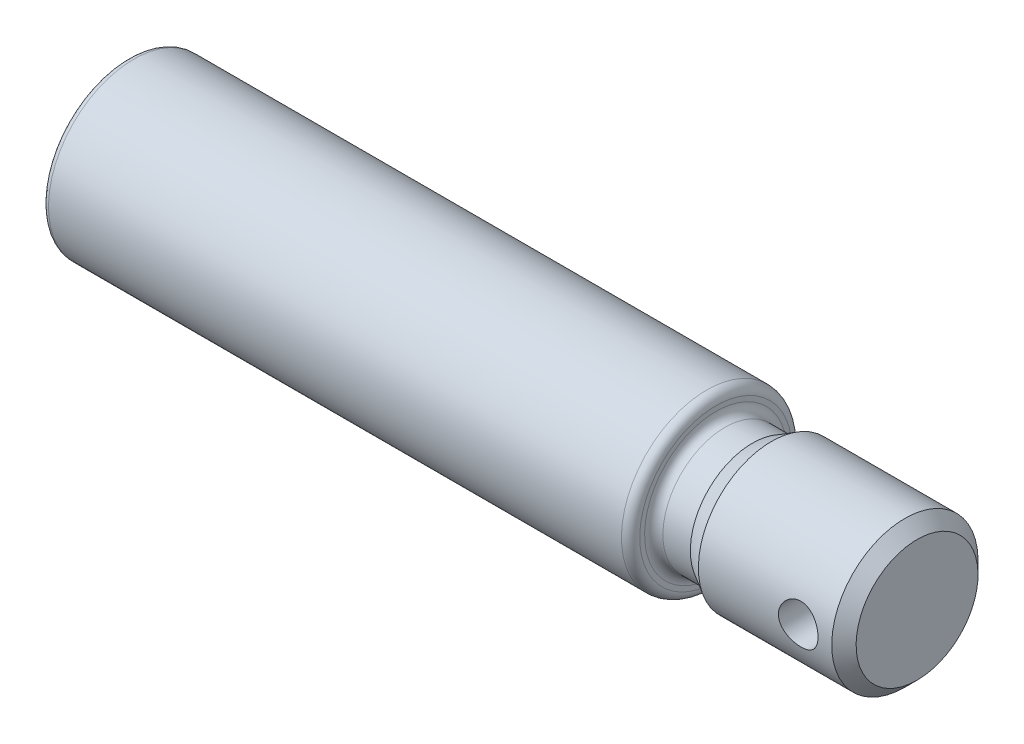
ISO-10303-21;
HEADER;
FILE_DESCRIPTION(('STEP AP214'),'2;1');
FILE_NAME('part.step','',(''),(''),'','','');
FILE_SCHEMA(('AUTOMOTIVE_DESIGN { 1 0 10303 214 1 1 1 1 }'));
ENDSEC;
DATA;
#1=APPLICATION_CONTEXT('core data for automotive mechanical design processes');
#2=APPLICATION_PROTOCOL_DEFINITION('international standard','automotive_design',2000,#1);
#3=PRODUCT_CONTEXT('',#1,'mechanical');
#4=PRODUCT('Part','Part','',(#3));
#5=PRODUCT_RELATED_PRODUCT_CATEGORY('part','',(#4));
#6=PRODUCT_DEFINITION_FORMATION('','',#4);
#7=PRODUCT_DEFINITION_CONTEXT('part definition',#1,'design');
#8=PRODUCT_DEFINITION('design','',#6,#7);
#9=PRODUCT_DEFINITION_SHAPE('','',#8);
#10=(LENGTH_UNIT() NAMED_UNIT(*) SI_UNIT(.MILLI.,.METRE.));
#11=(NAMED_UNIT(*) PLANE_ANGLE_UNIT() SI_UNIT($,.RADIAN.));
#12=(NAMED_UNIT(*) SI_UNIT($,.STERADIAN.) SOLID_ANGLE_UNIT());
#13=UNCERTAINTY_MEASURE_WITH_UNIT(LENGTH_MEASURE(1.E-05),#10,'distance_accuracy_value','');
#14=(GEOMETRIC_REPRESENTATION_CONTEXT(3) GLOBAL_UNCERTAINTY_ASSIGNED_CONTEXT((#13)) GLOBAL_UNIT_ASSIGNED_CONTEXT((#10,
#11,#12)) REPRESENTATION_CONTEXT('',''));
#15=CARTESIAN_POINT('',(0.,0.,0.));
#16=DIRECTION('',(0.,0.,1.));
#17=DIRECTION('',(1.,0.,0.));
#18=AXIS2_PLACEMENT_3D('',#15,#16,#17);
#19=CARTESIAN_POINT('',(129.5,10.0000000000006,0.));
#20=DIRECTION('',(-1.,0.,0.));
#21=DIRECTION('',(0.,-1.,0.));
#22=AXIS2_PLACEMENT_3D('',#19,#20,#21);
#23=PLANE('',#22);
#24=CARTESIAN_POINT('',(129.5,5.55111512312578E-13,0.));
#25=DIRECTION('',(-1.,0.,0.));
#26=DIRECTION('',(0.,-1.,0.));
#27=AXIS2_PLACEMENT_3D('',#24,#25,#26);
#28=CIRCLE('',#27,10.);
#29=CARTESIAN_POINT('',(129.5,-9.99999999999947,0.));
#30=VERTEX_POINT('',#29);
#31=EDGE_CURVE('E10',#30,#30,#28,.T.);
#32=ORIENTED_EDGE('',*,*,#31,.F.);
#33=EDGE_LOOP('',(#32));
#34=FACE_BOUND('',#33,.T.);
#35=ADVANCED_FACE('F45',(#34),#23,.F.);
#36=CARTESIAN_POINT('',(129.5,5.55111512312578E-13,0.));
#37=DIRECTION('',(-1.,0.,0.));
#38=DIRECTION('',(0.,-1.,0.));
#39=AXIS2_PLACEMENT_3D('',#36,#37,#38);
#40=CONICAL_SURFACE('',#39,10.,0.785398163397442);
#41=CARTESIAN_POINT('',(127.5,5.55111512312578E-13,0.));
#42=DIRECTION('',(-1.,0.,0.));
#43=DIRECTION('',(0.,-1.,0.));
#44=AXIS2_PLACEMENT_3D('',#41,#42,#43);
#45=CIRCLE('',#44,12.);
#46=CARTESIAN_POINT('',(127.5,-11.9999999999994,0.));
#47=VERTEX_POINT('',#46);
#48=EDGE_CURVE('E57',#47,#47,#45,.T.);
#49=ORIENTED_EDGE('',*,*,#48,.F.);
#50=EDGE_LOOP('',(#49));
#51=FACE_BOUND('',#50,.T.);
#52=ORIENTED_EDGE('',*,*,#31,.T.);
#53=EDGE_LOOP('',(#52));
#54=FACE_BOUND('',#53,.T.);
#55=ADVANCED_FACE('F113',(#51,#54),#40,.T.);
#56=CARTESIAN_POINT('',(-12.9941570986978,0.,0.));
#57=DIRECTION('',(-1.,0.,0.));
#58=DIRECTION('',(0.,-1.,0.));
#59=AXIS2_PLACEMENT_3D('',#56,#57,#58);
#60=CYLINDRICAL_SURFACE('',#59,12.);
#61=CARTESIAN_POINT('',(125.25,5.55111512312578E-13,-12.));
#62=CARTESIAN_POINT('',(125.249995968658,0.17905970581161,-11.9999974067524));
#63=CARTESIAN_POINT('',(125.235152423038,0.358162194554409,-11.9959528927753));
#64=CARTESIAN_POINT('',(125.176279744302,0.711200975041309,-11.9802115724022));
#65=CARTESIAN_POINT('',(125.132237209631,0.885134856214752,-11.9685112522283));
#66=CARTESIAN_POINT('',(125.016508571117,1.22268994025484,-11.9387486205651));
#67=CARTESIAN_POINT('',(124.944858733473,1.38632434626749,-11.9206946581914));
#68=CARTESIAN_POINT('',(124.776085542803,1.69925446326084,-11.8801289287596));
#69=CARTESIAN_POINT('',(124.678960280973,1.84854909865624,-11.8576168276963));
#70=CARTESIAN_POINT('',(124.45954784599,2.13212278463193,-11.8099614537859));
#71=CARTESIAN_POINT('',(124.336765666513,2.26601108976946,-11.7847721024861));
#72=CARTESIAN_POINT('',(124.070582500674,2.51157011150898,-11.7348945167404));
#73=CARTESIAN_POINT('',(123.927178774759,2.62323787142844,-11.7102063493743));
#74=CARTESIAN_POINT('',(123.620682093725,2.82310891286194,-11.6636532207235));
#75=CARTESIAN_POINT('',(123.457284257777,2.91085943069166,-11.6418462962767));
#76=CARTESIAN_POINT('',(123.117367929532,3.05748758676788,-11.6042035599793));
#77=CARTESIAN_POINT('',(122.940851948899,3.11637073578133,-11.5883666085971));
#78=CARTESIAN_POINT('',(122.584045033272,3.20222941743988,-11.5649332053982));
#79=CARTESIAN_POINT('',(122.40393724171,3.22991486946354,-11.5571537492437));
#80=CARTESIAN_POINT('',(122.041478377606,3.25480601359498,-11.550169658354));
#81=CARTESIAN_POINT('',(121.859127745363,3.25201759564893,-11.5509633666094));
#82=CARTESIAN_POINT('',(121.502927317824,3.21660303618256,-11.5608723211281));
#83=CARTESIAN_POINT('',(121.328984006372,3.18483941596985,-11.5697470027403));
#84=CARTESIAN_POINT('',(120.988992758671,3.09375898163074,-11.5944322882659));
#85=CARTESIAN_POINT('',(120.822945472364,3.03443990365648,-11.6102434620481));
#86=CARTESIAN_POINT('',(120.501228111676,2.88923777652297,-11.6472293753739));
#87=CARTESIAN_POINT('',(120.345700466042,2.80305508116802,-11.6684641027806));
#88=CARTESIAN_POINT('',(120.051013125676,2.60678105916498,-11.7138726695017));
#89=CARTESIAN_POINT('',(119.911856752961,2.49668489291539,-11.7380471033164));
#90=CARTESIAN_POINT('',(119.648938220494,2.25131402940869,-11.7876095533621));
#91=CARTESIAN_POINT('',(119.525852675321,2.1153160005296,-11.8130110161621));
#92=CARTESIAN_POINT('',(119.304094550353,1.82429747171834,-11.8614360880669));
#93=CARTESIAN_POINT('',(119.205422993634,1.66927617501864,-11.8844595974995));
#94=CARTESIAN_POINT('',(119.034982786059,1.34354227847815,-11.9256837284825));
#95=CARTESIAN_POINT('',(118.963339850026,1.17276084375125,-11.9438617004604));
#96=CARTESIAN_POINT('',(118.849978610778,0.82097222283663,-11.9731830268216));
#97=CARTESIAN_POINT('',(118.808253555637,0.639967353847,-11.9843279683646));
#98=CARTESIAN_POINT('',(118.75698245266,0.278641590545642,-11.9980861525499));
#99=CARTESIAN_POINT('',(118.74651685938,0.0984602598306734,-12.0009431238455));
#100=CARTESIAN_POINT('',(118.755517808259,-0.261084184609505,-11.9985059002692));
#101=CARTESIAN_POINT('',(118.774981151625,-0.440447383721336,-11.9932125764972));
#102=CARTESIAN_POINT('',(118.842534352927,-0.789959650603201,-11.9752272412402));
#103=CARTESIAN_POINT('',(118.890108409092,-0.960215908486088,-11.9626686250233));
#104=CARTESIAN_POINT('',(119.011931049501,-1.29031230453647,-11.9315801133749));
#105=CARTESIAN_POINT('',(119.086182569757,-1.45015129393458,-11.9130495607202));
#106=CARTESIAN_POINT('',(119.260938446033,-1.75842653087307,-11.8715050665028));
#107=CARTESIAN_POINT('',(119.361939201271,-1.90656999023862,-11.8484087017404));
#108=CARTESIAN_POINT('',(119.586705051626,-2.18412739789426,-11.8004008855669));
#109=CARTESIAN_POINT('',(119.710474789748,-2.31353751648422,-11.7754890645785));
#110=CARTESIAN_POINT('',(119.981561112471,-2.55385110168736,-11.7257564789882));
#111=CARTESIAN_POINT('',(120.129459027447,-2.66410496164846,-11.7009595471868));
#112=CARTESIAN_POINT('',(120.442184282131,-2.85824692896555,-11.6550595829588));
#113=CARTESIAN_POINT('',(120.607010934299,-2.94213610653078,-11.633956400609));
#114=CARTESIAN_POINT('',(120.948116653977,-3.08053773002734,-11.5980775102852));
#115=CARTESIAN_POINT('',(121.124323629229,-3.13521800136942,-11.5832657566779));
#116=CARTESIAN_POINT('',(121.48390290422,-3.21403129504761,-11.561648011896));
#117=CARTESIAN_POINT('',(121.667273288749,-3.23817242548535,-11.5548398958001));
#118=CARTESIAN_POINT('',(122.029312478254,-3.25474510799825,-11.5501816926216));
#119=CARTESIAN_POINT('',(122.207930318296,-3.24822238145995,-11.5520361733043));
#120=CARTESIAN_POINT('',(122.561417070929,-3.2060866129053,-11.5638002901636));
#121=CARTESIAN_POINT('',(122.736286085691,-3.17047436473749,-11.5737097065222));
#122=CARTESIAN_POINT('',(123.075948582593,-3.07178543854636,-11.6002885077611));
#123=CARTESIAN_POINT('',(123.240813071938,-3.00893693198138,-11.6169016542655));
#124=CARTESIAN_POINT('',(123.557783756721,-2.85773638384207,-11.6550158478239));
#125=CARTESIAN_POINT('',(123.709887888707,-2.7693802276979,-11.6765176833402));
#126=CARTESIAN_POINT('',(124.001995426499,-2.56653115950093,-11.7227997742047));
#127=CARTESIAN_POINT('',(124.141492933354,-2.45132781105256,-11.7476595881303));
#128=CARTESIAN_POINT('',(124.399515607991,-2.19939701750478,-11.7974196972471));
#129=CARTESIAN_POINT('',(124.518035632801,-2.06266430961256,-11.8223200008592));
#130=CARTESIAN_POINT('',(124.733339058895,-1.76788132092567,-11.8700190493945));
#131=CARTESIAN_POINT('',(124.82957943055,-1.60942401231725,-11.8927586224686));
#132=CARTESIAN_POINT('',(124.993905020623,-1.2779673527621,-11.9329201974515));
#133=CARTESIAN_POINT('',(125.062007742893,-1.10497712329624,-11.9503455034841));
#134=CARTESIAN_POINT('',(125.159565931559,-0.777269600583784,-11.9757471116275));
#135=CARTESIAN_POINT('',(125.193398457315,-0.62392280233898,-11.9847746493288));
#136=CARTESIAN_POINT('',(125.238616072203,-0.313728035277748,-11.9969019165161));
#137=CARTESIAN_POINT('',(125.250003531999,-0.15688043798819,-12.0000022720344));
#138=CARTESIAN_POINT('',(125.25,5.55111512312578E-13,-12.));
#139=B_SPLINE_CURVE_WITH_KNOTS('',3,(#61,#62,#63,#64,#65,#66,#67,#68,#69,#70,#71,#72,#73,#74,
#75,#76,#77,#78,#79,#80,#81,#82,#83,#84,#85,#86,#87,#88,#89,#90,#91,#92,#93,#94,#95,#96,#97,#98,
#99,#100,#101,#102,#103,#104,#105,#106,#107,#108,#109,#110,#111,#112,#113,#114,#115,#116,#117,
#118,#119,#120,#121,#122,#123,#124,#125,#126,#127,#128,#129,#130,#131,#132,#133,#134,#135,#136,
#137,#138),.UNSPECIFIED.,.T.,.F.,(4,2,2,2,2,2,2,2,2,2,2,2,2,2,2,2,2,2,2,2,2,2,2,2,2,2,2,2,2,2,2,
2,2,2,2,2,2,2,4),(0.,0.536603686967457,1.07345383133191,1.60960113633246,2.14578862486053,
2.69347659190609,3.24123738606654,3.79874263599249,4.35614141694947,4.90058263833547,
5.44491863275914,5.97356174543564,6.50224829703074,7.03705682658456,7.57197369155271,
8.12491274402294,8.67787496361445,9.2333782954436,9.78875622071634,10.3276275625482,
10.8664413140541,11.3956626546246,11.9249422569342,12.4648311673786,13.0048302931622,
13.5605740219902,14.1162951888582,14.6687880389374,15.2211341720865,15.754783138685,
16.2884175425725,16.8176653274109,17.3469985315229,17.8923606397131,18.4378562677327,
18.9955036103094,19.5528035277476,20.0229903511971,20.4931275105123),.UNSPECIFIED.);
#140=CARTESIAN_POINT('',(125.25,5.55111512312578E-13,-12.));
#141=VERTEX_POINT('',#140);
#142=EDGE_CURVE('E48',#141,#141,#139,.T.);
#143=ORIENTED_EDGE('',*,*,#142,.T.);
#144=EDGE_LOOP('',(#143));
#145=FACE_BOUND('',#144,.T.);
#146=CARTESIAN_POINT('',(125.25,1.11022302462516E-13,12.));
#147=CARTESIAN_POINT('',(125.249995968658,-0.179059705810944,11.9999974067525));
#148=CARTESIAN_POINT('',(125.235152423038,-0.358162194553735,11.9959528927754));
#149=CARTESIAN_POINT('',(125.176279744302,-0.711200975040643,11.9802115724023));
#150=CARTESIAN_POINT('',(125.132237209631,-0.885134856214103,11.9685112522283));
#151=CARTESIAN_POINT('',(125.016508571117,-1.22268994025416,11.9387486205651));
#152=CARTESIAN_POINT('',(124.944858733473,-1.38632434626675,11.9206946581916));
#153=CARTESIAN_POINT('',(124.776085542803,-1.69925446326012,11.8801289287597));
#154=CARTESIAN_POINT('',(124.678960280973,-1.8485490986556,11.8576168276963));
#155=CARTESIAN_POINT('',(124.45954784599,-2.13212278463124,11.8099614537859));
#156=CARTESIAN_POINT('',(124.336765666513,-2.26601108976863,11.7847721024863));
#157=CARTESIAN_POINT('',(124.070582500673,-2.51157011150817,11.7348945167406));
#158=CARTESIAN_POINT('',(123.927178774759,-2.6232378714278,11.7102063493742));
#159=CARTESIAN_POINT('',(123.620682093725,-2.82310891286125,11.6636532207235));
#160=CARTESIAN_POINT('',(123.457284257777,-2.91085943069075,11.641846296277));
#161=CARTESIAN_POINT('',(123.117367929532,-3.05748758676687,11.6042035599795));
#162=CARTESIAN_POINT('',(122.940851948899,-3.11637073578044,11.5883666085971));
#163=CARTESIAN_POINT('',(122.584045033272,-3.20222941743899,11.5649332053982));
#164=CARTESIAN_POINT('',(122.40393724171,-3.22991486946253,11.557153749244));
#165=CARTESIAN_POINT('',(122.041478377606,-3.25480601359397,11.5501696583543));
#166=CARTESIAN_POINT('',(121.859127745363,-3.25201759564804,11.5509633666095));
#167=CARTESIAN_POINT('',(121.502927317824,-3.21660303618167,11.5608723211281));
#168=CARTESIAN_POINT('',(121.328984006372,-3.18483941596886,11.5697470027406));
#169=CARTESIAN_POINT('',(120.988992758671,-3.09375898162974,11.5944322882662));
#170=CARTESIAN_POINT('',(120.822945472364,-3.03443990365559,11.6102434620482));
#171=CARTESIAN_POINT('',(120.501228111676,-2.8892377765221,11.647229375374));
#172=CARTESIAN_POINT('',(120.345700466042,-2.80305508116705,11.6684641027809));
#173=CARTESIAN_POINT('',(120.051013125677,-2.6067810591641,11.7138726695019));
#174=CARTESIAN_POINT('',(119.911856752961,-2.49668489291468,11.7380471033164));
#175=CARTESIAN_POINT('',(119.648938220494,-2.25131402940805,11.7876095533621));
#176=CARTESIAN_POINT('',(119.525852675321,-2.11531600052883,11.8130110161623));
#177=CARTESIAN_POINT('',(119.304094550354,-1.82429747171755,11.8614360880671));
#178=CARTESIAN_POINT('',(119.205422993634,-1.66927617501795,11.8844595974995));
#179=CARTESIAN_POINT('',(119.034982786059,-1.34354227847751,11.9256837284825));
#180=CARTESIAN_POINT('',(118.963339850027,-1.17276084375055,11.9438617004605));
#181=CARTESIAN_POINT('',(118.849978610778,-0.820972222835921,11.9731830268217));
#182=CARTESIAN_POINT('',(118.808253555637,-0.639967353846321,11.9843279683647));
#183=CARTESIAN_POINT('',(118.75698245266,-0.278641590544986,11.99808615255));
#184=CARTESIAN_POINT('',(118.74651685938,-0.0984602598300128,12.0009431238456));
#185=CARTESIAN_POINT('',(118.755517808259,0.261084184610166,11.9985059002693));
#186=CARTESIAN_POINT('',(118.774981151625,0.440447383721992,11.9932125764973));
#187=CARTESIAN_POINT('',(118.842534352927,0.789959650603914,11.9752272412402));
#188=CARTESIAN_POINT('',(118.890108409091,0.960215908486861,11.9626686250233));
#189=CARTESIAN_POINT('',(119.011931049501,1.29031230453731,11.931580113375));
#190=CARTESIAN_POINT('',(119.086182569757,1.45015129393543,11.9130495607203));
#191=CARTESIAN_POINT('',(119.260938446033,1.75842653087395,11.8715050665029));
#192=CARTESIAN_POINT('',(119.361939201271,1.90656999023954,11.8484087017403));
#193=CARTESIAN_POINT('',(119.586705051626,2.18412739789505,11.8004008855669));
#194=CARTESIAN_POINT('',(119.710474789748,2.31353751648486,11.7754890645786));
#195=CARTESIAN_POINT('',(119.981561112471,2.55385110168807,11.7257564789882));
#196=CARTESIAN_POINT('',(120.129459027447,2.66410496164939,11.7009595471867));
#197=CARTESIAN_POINT('',(120.442184282131,2.85824692896644,11.6550595829587));
#198=CARTESIAN_POINT('',(120.607010934299,2.94213610653141,11.6339564006091));
#199=CARTESIAN_POINT('',(120.948116653977,3.08053773002804,11.5980775102852));
#200=CARTESIAN_POINT('',(121.124323629229,3.13521800137042,11.5832657566777));
#201=CARTESIAN_POINT('',(121.48390290422,3.21403129504859,11.5616480118958));
#202=CARTESIAN_POINT('',(121.667273288749,3.23817242548601,11.5548398958001));
#203=CARTESIAN_POINT('',(122.029312478254,3.25474510799892,11.5501816926216));
#204=CARTESIAN_POINT('',(122.207930318296,3.24822238146095,11.5520361733041));
#205=CARTESIAN_POINT('',(122.561417070929,3.20608661290631,11.5638002901635));
#206=CARTESIAN_POINT('',(122.736286085691,3.17047436473817,11.5737097065222));
#207=CARTESIAN_POINT('',(123.075948582593,3.071785438547,11.6002885077612));
#208=CARTESIAN_POINT('',(123.240813071938,3.0089369319823,11.6169016542654));
#209=CARTESIAN_POINT('',(123.557783756721,2.85773638384302,11.6550158478238));
#210=CARTESIAN_POINT('',(123.709887888707,2.76938022769861,11.6765176833402));
#211=CARTESIAN_POINT('',(124.001995426499,2.56653115950157,11.7227997742047));
#212=CARTESIAN_POINT('',(124.141492933354,2.4513278110534,11.7476595881302));
#213=CARTESIAN_POINT('',(124.399515607992,2.19939701750575,11.7974196972471));
#214=CARTESIAN_POINT('',(124.518035632801,2.06266430961346,11.8223200008592));
#215=CARTESIAN_POINT('',(124.733339058895,1.76788132092653,11.8700190493946));
#216=CARTESIAN_POINT('',(124.82957943055,1.60942401231816,11.8927586224686));
#217=CARTESIAN_POINT('',(124.993905020623,1.27796735276302,11.9329201974515));
#218=CARTESIAN_POINT('',(125.062007742893,1.10497712329713,11.9503455034841));
#219=CARTESIAN_POINT('',(125.159565931559,0.777269600584631,11.9757471116275));
#220=CARTESIAN_POINT('',(125.193398457315,0.623922802339795,11.9847746493288));
#221=CARTESIAN_POINT('',(125.238616072203,0.31372803527849,11.9969019165162));
#222=CARTESIAN_POINT('',(125.250003531999,0.156880437988891,12.0000022720344));
#223=CARTESIAN_POINT('',(125.25,1.11022302462516E-13,12.));
#224=B_SPLINE_CURVE_WITH_KNOTS('',3,(#146,#147,#148,#149,#150,#151,#152,#153,#154,#155,#156,
#157,#158,#159,#160,#161,#162,#163,#164,#165,#166,#167,#168,#169,#170,#171,#172,#173,#174,#175,
#176,#177,#178,#179,#180,#181,#182,#183,#184,#185,#186,#187,#188,#189,#190,#191,#192,#193,#194,
#195,#196,#197,#198,#199,#200,#201,#202,#203,#204,#205,#206,#207,#208,#209,#210,#211,#212,#213,
#214,#215,#216,#217,#218,#219,#220,#221,#222,#223),.UNSPECIFIED.,.T.,.F.,(4,2,2,2,2,2,2,2,2,2,2,
2,2,2,2,2,2,2,2,2,2,2,2,2,2,2,2,2,2,2,2,2,2,2,2,2,2,2,4),(0.,0.536603686967456,1.0734538313319,
1.60960113633244,2.1457886248605,2.69347659190606,3.24123738606647,3.79874263599235,
4.35614141694927,4.90058263833527,5.4449186327589,5.97356174543537,6.50224829703048,
7.03705682658422,7.57197369155228,8.1249127440225,8.67787496361399,9.23337829544314,
9.78875622071586,10.3276275625477,10.8664413140536,11.3956626546243,11.9249422569339,
12.4648311673782,13.0048302931618,13.5605740219899,14.1162951888578,14.6687880389371,
15.2211341720862,15.7547831386848,16.2884175425723,16.8176653274107,17.3469985315227,
17.8923606397129,18.4378562677324,18.9955036103091,19.5528035277473,20.022990351197,
20.4931275105123),.UNSPECIFIED.);
#225=CARTESIAN_POINT('',(125.25,1.11022302462516E-13,12.));
#226=VERTEX_POINT('',#225);
#227=EDGE_CURVE('E65',#226,#226,#224,.T.);
#228=ORIENTED_EDGE('',*,*,#227,.T.);
#229=EDGE_LOOP('',(#228));
#230=FACE_BOUND('',#229,.T.);
#231=CARTESIAN_POINT('',(105.617691453624,5.55111512312578E-13,0.));
#232=DIRECTION('',(-1.,0.,0.));
#233=DIRECTION('',(0.,-1.,0.));
#234=AXIS2_PLACEMENT_3D('',#231,#232,#233);
#235=CIRCLE('',#234,12.);
#236=CARTESIAN_POINT('',(105.617691453624,-11.9999999999994,0.));
#237=VERTEX_POINT('',#236);
#238=EDGE_CURVE('E62',#237,#237,#235,.T.);
#239=ORIENTED_EDGE('',*,*,#238,.F.);
#240=EDGE_LOOP('',(#239));
#241=FACE_BOUND('',#240,.T.);
#242=ORIENTED_EDGE('',*,*,#48,.T.);
#243=EDGE_LOOP('',(#242));
#244=FACE_BOUND('',#243,.T.);
#245=ADVANCED_FACE('F70',(#145,#230,#241,#244),#60,.T.);
#246=CARTESIAN_POINT('',(105.617691453624,5.55111512312578E-13,0.));
#247=DIRECTION('',(1.,0.,0.));
#248=DIRECTION('',(0.,1.,0.));
#249=AXIS2_PLACEMENT_3D('',#246,#247,#248);
#250=CONICAL_SURFACE('',#249,12.,0.5235987755983);
#251=CARTESIAN_POINT('',(102.5,5.55111512312578E-13,0.));
#252=DIRECTION('',(-1.,0.,0.));
#253=DIRECTION('',(0.,-1.,0.));
#254=AXIS2_PLACEMENT_3D('',#251,#252,#253);
#255=CIRCLE('',#254,10.2);
#256=CARTESIAN_POINT('',(102.5,-10.1999999999994,0.));
#257=VERTEX_POINT('',#256);
#258=EDGE_CURVE('E175',#257,#257,#255,.T.);
#259=ORIENTED_EDGE('',*,*,#258,.F.);
#260=EDGE_LOOP('',(#259));
#261=FACE_BOUND('',#260,.T.);
#262=ORIENTED_EDGE('',*,*,#238,.T.);
#263=EDGE_LOOP('',(#262));
#264=FACE_BOUND('',#263,.T.);
#265=ADVANCED_FACE('F105',(#261,#264),#250,.T.);
#266=CARTESIAN_POINT('',(-12.9941570986978,0.,0.));
#267=DIRECTION('',(-1.,0.,0.));
#268=DIRECTION('',(0.,-1.,0.));
#269=AXIS2_PLACEMENT_3D('',#266,#267,#268);
#270=CYLINDRICAL_SURFACE('',#269,10.2);
#271=CARTESIAN_POINT('',(98.0000000000003,5.55111512312578E-13,0.));
#272=DIRECTION('',(-1.,0.,0.));
#273=DIRECTION('',(0.,-1.,0.));
#274=AXIS2_PLACEMENT_3D('',#271,#272,#273);
#275=CIRCLE('',#274,10.2);
#276=CARTESIAN_POINT('',(98.0000000000003,-10.1999999999994,0.));
#277=VERTEX_POINT('',#276);
#278=EDGE_CURVE('E179',#277,#277,#275,.T.);
#279=ORIENTED_EDGE('',*,*,#278,.F.);
#280=EDGE_LOOP('',(#279));
#281=FACE_BOUND('',#280,.T.);
#282=ORIENTED_EDGE('',*,*,#258,.T.);
#283=EDGE_LOOP('',(#282));
#284=FACE_BOUND('',#283,.T.);
#285=ADVANCED_FACE('F102',(#281,#284),#270,.T.);
#286=CARTESIAN_POINT('',(98.0000000000003,5.55111512312578E-13,0.));
#287=DIRECTION('',(-1.,0.,0.));
#288=DIRECTION('',(0.,-1.,0.));
#289=AXIS2_PLACEMENT_3D('',#286,#287,#288);
#290=TOROIDAL_SURFACE('',#289,11.7,1.5);
#291=CARTESIAN_POINT('',(96.5000000000004,5.55111512312578E-13,0.));
#292=DIRECTION('',(-1.,0.,0.));
#293=DIRECTION('',(0.,-1.,0.));
#294=AXIS2_PLACEMENT_3D('',#291,#292,#293);
#295=CIRCLE('',#294,11.7);
#296=CARTESIAN_POINT('',(96.5000000000004,-11.6999999999994,0.));
#297=VERTEX_POINT('',#296);
#298=EDGE_CURVE('E184',#297,#297,#295,.T.);
#299=ORIENTED_EDGE('',*,*,#298,.F.);
#300=EDGE_LOOP('',(#299));
#301=FACE_BOUND('',#300,.T.);
#302=ORIENTED_EDGE('',*,*,#278,.T.);
#303=EDGE_LOOP('',(#302));
#304=FACE_BOUND('',#303,.T.);
#305=ADVANCED_FACE('F98',(#301,#304),#290,.F.);
#306=CARTESIAN_POINT('',(96.5000000000004,12.5000000000005,0.));
#307=DIRECTION('',(-1.,0.,0.));
#308=DIRECTION('',(0.,-1.,0.));
#309=AXIS2_PLACEMENT_3D('',#306,#307,#308);
#310=PLANE('',#309);
#311=CARTESIAN_POINT('',(96.5000000000004,5.55111512312578E-13,0.));
#312=DIRECTION('',(-1.,0.,0.));
#313=DIRECTION('',(0.,-1.,0.));
#314=AXIS2_PLACEMENT_3D('',#311,#312,#313);
#315=CIRCLE('',#314,12.5);
#316=CARTESIAN_POINT('',(96.5000000000004,-12.4999999999994,0.));
#317=VERTEX_POINT('',#316);
#318=EDGE_CURVE('E187',#317,#317,#315,.T.);
#319=ORIENTED_EDGE('',*,*,#318,.F.);
#320=EDGE_LOOP('',(#319));
#321=FACE_BOUND('',#320,.T.);
#322=ORIENTED_EDGE('',*,*,#298,.T.);
#323=EDGE_LOOP('',(#322));
#324=FACE_BOUND('',#323,.T.);
#325=ADVANCED_FACE('F94',(#321,#324),#310,.F.);
#326=CARTESIAN_POINT('',(95.0000000000003,5.55111512312578E-13,0.));
#327=DIRECTION('',(-1.,0.,0.));
#328=DIRECTION('',(0.,-1.,0.));
#329=AXIS2_PLACEMENT_3D('',#326,#327,#328);
#330=TOROIDAL_SURFACE('',#329,12.5,1.5);
#331=CARTESIAN_POINT('',(95.0000000000003,5.55111512312578E-13,0.));
#332=DIRECTION('',(-1.,0.,0.));
#333=DIRECTION('',(0.,-1.,0.));
#334=AXIS2_PLACEMENT_3D('',#331,#332,#333);
#335=CIRCLE('',#334,14.);
#336=CARTESIAN_POINT('',(95.0000000000003,-13.9999999999994,0.));
#337=VERTEX_POINT('',#336);
#338=EDGE_CURVE('E190',#337,#337,#335,.T.);
#339=ORIENTED_EDGE('',*,*,#338,.F.);
#340=EDGE_LOOP('',(#339));
#341=FACE_BOUND('',#340,.T.);
#342=ORIENTED_EDGE('',*,*,#318,.T.);
#343=EDGE_LOOP('',(#342));
#344=FACE_BOUND('',#343,.T.);
#345=ADVANCED_FACE('F90',(#341,#344),#330,.T.);
#346=CARTESIAN_POINT('',(-12.9941570986978,0.,0.));
#347=DIRECTION('',(-1.,0.,0.));
#348=DIRECTION('',(0.,-1.,0.));
#349=AXIS2_PLACEMENT_3D('',#346,#347,#348);
#350=CYLINDRICAL_SURFACE('',#349,14.);
#351=CARTESIAN_POINT('',(1.00000000000017,0.,0.));
#352=DIRECTION('',(-1.,0.,0.));
#353=DIRECTION('',(0.,-1.,0.));
#354=AXIS2_PLACEMENT_3D('',#351,#352,#353);
#355=CIRCLE('',#354,14.);
#356=CARTESIAN_POINT('',(1.00000000000016,-14.,0.));
#357=VERTEX_POINT('',#356);
#358=EDGE_CURVE('E193',#357,#357,#355,.T.);
#359=ORIENTED_EDGE('',*,*,#358,.F.);
#360=EDGE_LOOP('',(#359));
#361=FACE_BOUND('',#360,.T.);
#362=ORIENTED_EDGE('',*,*,#338,.T.);
#363=EDGE_LOOP('',(#362));
#364=FACE_BOUND('',#363,.T.);
#365=ADVANCED_FACE('F86',(#361,#364),#350,.T.);
#366=CARTESIAN_POINT('',(1.00000000000017,0.,0.));
#367=DIRECTION('',(-1.,0.,0.));
#368=DIRECTION('',(0.,-1.,0.));
#369=AXIS2_PLACEMENT_3D('',#366,#367,#368);
#370=TOROIDAL_SURFACE('',#369,13.,1.);
#371=CARTESIAN_POINT('',(1.66533453693773E-13,0.,0.));
#372=DIRECTION('',(-1.,0.,0.));
#373=DIRECTION('',(0.,-1.,0.));
#374=AXIS2_PLACEMENT_3D('',#371,#372,#373);
#375=CIRCLE('',#374,13.);
#376=CARTESIAN_POINT('',(1.5810802331026E-13,-13.,0.));
#377=VERTEX_POINT('',#376);
#378=EDGE_CURVE('E196',#377,#377,#375,.T.);
#379=ORIENTED_EDGE('',*,*,#378,.F.);
#380=EDGE_LOOP('',(#379));
#381=FACE_BOUND('',#380,.T.);
#382=ORIENTED_EDGE('',*,*,#358,.T.);
#383=EDGE_LOOP('',(#382));
#384=FACE_BOUND('',#383,.T.);
#385=ADVANCED_FACE('F82',(#381,#384),#370,.T.);
#386=CARTESIAN_POINT('',(1.66533453693773E-13,12.9999999999999,0.));
#387=DIRECTION('',(1.,0.,0.));
#388=DIRECTION('',(0.,1.,0.));
#389=AXIS2_PLACEMENT_3D('',#386,#387,#388);
#390=PLANE('',#389);
#391=ORIENTED_EDGE('',*,*,#378,.T.);
#392=EDGE_LOOP('',(#391));
#393=FACE_BOUND('',#392,.T.);
#394=ADVANCED_FACE('F77',(#393),#390,.F.);
#395=CARTESIAN_POINT('',(122.,5.55111512312578E-13,-25.));
#396=DIRECTION('',(0.,0.,1.));
#397=DIRECTION('',(1.,0.,0.));
#398=AXIS2_PLACEMENT_3D('',#395,#396,#397);
#399=CYLINDRICAL_SURFACE('',#398,3.25000000000001);
#400=ORIENTED_EDGE('',*,*,#227,.F.);
#401=EDGE_LOOP('',(#400));
#402=FACE_BOUND('',#401,.T.);
#403=ORIENTED_EDGE('',*,*,#142,.F.);
#404=EDGE_LOOP('',(#403));
#405=FACE_BOUND('',#404,.T.);
#406=ADVANCED_FACE('F73',(#402,#405),#399,.F.);
#407=CLOSED_SHELL('',(#35,#55,#245,#265,#285,#305,#325,#345,#365,#385,#394,#406));
#408=MANIFOLD_SOLID_BREP('B2',#407);
#409=ADVANCED_BREP_SHAPE_REPRESENTATION('',(#18,#408),#14);
#410=SHAPE_DEFINITION_REPRESENTATION(#9,#409);
ENDSEC;
END-ISO-10303-21;
